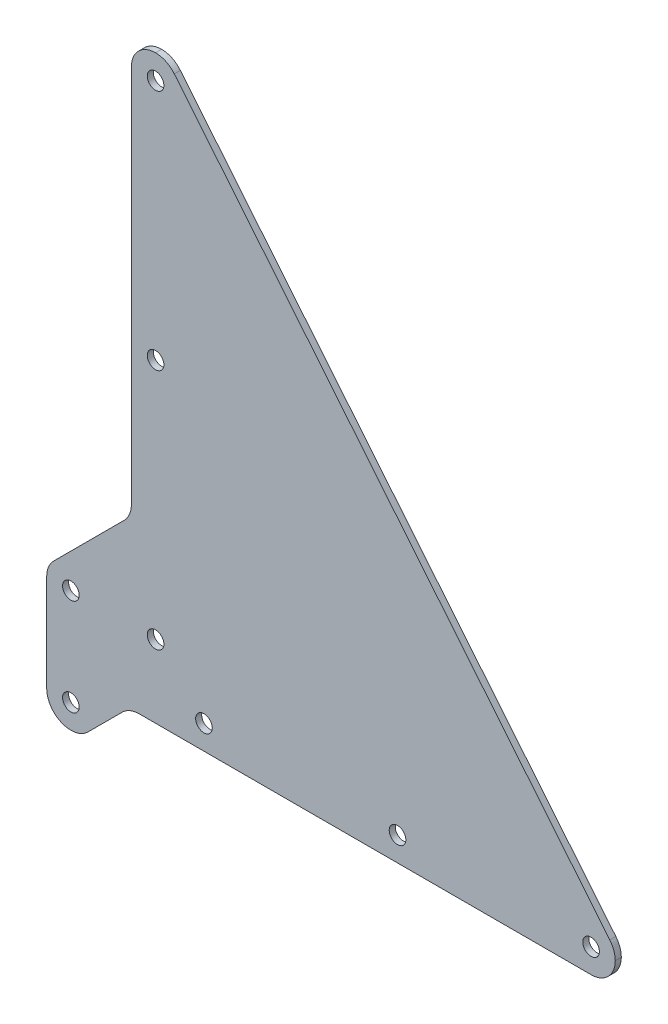
ISO-10303-21;
HEADER;
FILE_DESCRIPTION(('STEP AP214'),'2;1');
FILE_NAME('part.step','',(''),(''),'','','');
FILE_SCHEMA(('AUTOMOTIVE_DESIGN { 1 0 10303 214 1 1 1 1 }'));
ENDSEC;
DATA;
#1=APPLICATION_CONTEXT('core data for automotive mechanical design processes');
#2=APPLICATION_PROTOCOL_DEFINITION('international standard','automotive_design',2000,#1);
#3=PRODUCT_CONTEXT('',#1,'mechanical');
#4=PRODUCT('Part','Part','',(#3));
#5=PRODUCT_RELATED_PRODUCT_CATEGORY('part','',(#4));
#6=PRODUCT_DEFINITION_FORMATION('','',#4);
#7=PRODUCT_DEFINITION_CONTEXT('part definition',#1,'design');
#8=PRODUCT_DEFINITION('design','',#6,#7);
#9=PRODUCT_DEFINITION_SHAPE('','',#8);
#10=(LENGTH_UNIT() NAMED_UNIT(*) SI_UNIT(.MILLI.,.METRE.));
#11=(NAMED_UNIT(*) PLANE_ANGLE_UNIT() SI_UNIT($,.RADIAN.));
#12=(NAMED_UNIT(*) SI_UNIT($,.STERADIAN.) SOLID_ANGLE_UNIT());
#13=UNCERTAINTY_MEASURE_WITH_UNIT(LENGTH_MEASURE(1.E-05),#10,'distance_accuracy_value','');
#14=(GEOMETRIC_REPRESENTATION_CONTEXT(3) GLOBAL_UNCERTAINTY_ASSIGNED_CONTEXT((#13)) GLOBAL_UNIT_ASSIGNED_CONTEXT((#10,
#11,#12)) REPRESENTATION_CONTEXT('',''));
#15=CARTESIAN_POINT('',(0.,0.,0.));
#16=DIRECTION('',(0.,0.,1.));
#17=DIRECTION('',(1.,0.,0.));
#18=AXIS2_PLACEMENT_3D('',#15,#16,#17);
#19=CARTESIAN_POINT('',(0.,0.,0.79375));
#20=DIRECTION('',(0.,0.,1.));
#21=DIRECTION('',(1.,0.,0.));
#22=AXIS2_PLACEMENT_3D('',#19,#20,#21);
#23=PLANE('',#22);
#24=CARTESIAN_POINT('',(114.3,-12.7,0.79375));
#25=DIRECTION('',(0.,0.,1.));
#26=DIRECTION('',(1.,0.,0.));
#27=AXIS2_PLACEMENT_3D('',#24,#25,#26);
#28=CIRCLE('',#27,2.1828125);
#29=CARTESIAN_POINT('',(116.4828125,-12.7,0.79375));
#30=VERTEX_POINT('',#29);
#31=EDGE_CURVE('E366',#30,#30,#28,.T.);
#32=ORIENTED_EDGE('',*,*,#31,.F.);
#33=EDGE_LOOP('',(#32));
#34=FACE_BOUND('',#33,.T.);
#35=CARTESIAN_POINT('',(-22.225,0.,0.79375));
#36=DIRECTION('',(0.,0.,1.));
#37=DIRECTION('',(1.,0.,0.));
#38=AXIS2_PLACEMENT_3D('',#35,#36,#37);
#39=CIRCLE('',#38,2.1828125);
#40=CARTESIAN_POINT('',(-20.0421875,0.,0.79375));
#41=VERTEX_POINT('',#40);
#42=EDGE_CURVE('E350',#41,#41,#39,.T.);
#43=ORIENTED_EDGE('',*,*,#42,.F.);
#44=EDGE_LOOP('',(#43));
#45=FACE_BOUND('',#44,.T.);
#46=CARTESIAN_POINT('',(12.7,-12.7,0.79375));
#47=DIRECTION('',(0.,0.,1.));
#48=DIRECTION('',(1.,0.,0.));
#49=AXIS2_PLACEMENT_3D('',#46,#47,#48);
#50=CIRCLE('',#49,2.1828125);
#51=CARTESIAN_POINT('',(14.8828125,-12.7,0.79375));
#52=VERTEX_POINT('',#51);
#53=EDGE_CURVE('E334',#52,#52,#50,.T.);
#54=ORIENTED_EDGE('',*,*,#53,.F.);
#55=EDGE_LOOP('',(#54));
#56=FACE_BOUND('',#55,.T.);
#57=CARTESIAN_POINT('',(0.,0.,0.79375));
#58=DIRECTION('',(0.,0.,1.));
#59=DIRECTION('',(1.,0.,0.));
#60=AXIS2_PLACEMENT_3D('',#57,#58,#59);
#61=CIRCLE('',#60,2.1828125);
#62=CARTESIAN_POINT('',(2.1828125,0.,0.79375));
#63=VERTEX_POINT('',#62);
#64=EDGE_CURVE('E167',#63,#63,#61,.T.);
#65=ORIENTED_EDGE('',*,*,#64,.F.);
#66=EDGE_LOOP('',(#65));
#67=FACE_BOUND('',#66,.T.);
#68=DIRECTION('',(1.,0.,0.));
#69=VECTOR('',#68,1.);
#70=CARTESIAN_POINT('',(-6.89474387893088,-19.05,0.79375));
#71=LINE('',#70,#69);
#72=CARTESIAN_POINT('',(-4.26448775786173,-19.05,0.79375));
#73=VERTEX_POINT('',#72);
#74=CARTESIAN_POINT('',(114.3,-19.05,0.79375));
#75=VERTEX_POINT('',#74);
#76=EDGE_CURVE('E179',#73,#75,#71,.T.);
#77=ORIENTED_EDGE('',*,*,#76,.T.);
#78=CARTESIAN_POINT('',(114.3,-12.7,0.79375));
#79=DIRECTION('',(0.,0.,1.));
#80=DIRECTION('',(1.,0.,0.));
#81=AXIS2_PLACEMENT_3D('',#78,#79,#80);
#82=CIRCLE('',#81,6.35);
#83=CARTESIAN_POINT('',(120.65,-12.7,0.79375));
#84=VERTEX_POINT('',#83);
#85=EDGE_CURVE('E224',#75,#84,#82,.T.);
#86=ORIENTED_EDGE('',*,*,#85,.T.);
#87=CARTESIAN_POINT('',(114.3,-12.7,0.79375));
#88=DIRECTION('',(0.,0.,1.));
#89=DIRECTION('',(1.,0.,0.));
#90=AXIS2_PLACEMENT_3D('',#87,#88,#89);
#91=CIRCLE('',#90,6.35);
#92=CARTESIAN_POINT('',(119.214628849941,-8.67894003186637,0.79375));
#93=VERTEX_POINT('',#92);
#94=EDGE_CURVE('E221',#84,#93,#91,.T.);
#95=ORIENTED_EDGE('',*,*,#94,.T.);
#96=DIRECTION('',(-0.633237790257263,0.773957299203321,0.));
#97=VECTOR('',#96,1.);
#98=CARTESIAN_POINT('',(120.65,-10.433282548605,0.79375));
#99=LINE('',#98,#97);
#100=CARTESIAN_POINT('',(4.91462884994102,131.021059968134,0.79375));
#101=VERTEX_POINT('',#100);
#102=EDGE_CURVE('E172',#93,#101,#99,.T.);
#103=ORIENTED_EDGE('',*,*,#102,.T.);
#104=CARTESIAN_POINT('',(0.,127.,0.79375));
#105=DIRECTION('',(0.,0.,1.));
#106=DIRECTION('',(1.,0.,0.));
#107=AXIS2_PLACEMENT_3D('',#104,#105,#106);
#108=CIRCLE('',#107,6.35);
#109=CARTESIAN_POINT('',(0.,133.35,0.79375));
#110=VERTEX_POINT('',#109);
#111=EDGE_CURVE('E54',#101,#110,#108,.T.);
#112=ORIENTED_EDGE('',*,*,#111,.T.);
#113=CARTESIAN_POINT('',(0.,127.,0.79375));
#114=DIRECTION('',(0.,0.,1.));
#115=DIRECTION('',(1.,0.,0.));
#116=AXIS2_PLACEMENT_3D('',#113,#114,#115);
#117=CIRCLE('',#116,6.35);
#118=CARTESIAN_POINT('',(-6.35000000000002,127.,0.79375));
#119=VERTEX_POINT('',#118);
#120=EDGE_CURVE('E207',#110,#119,#117,.T.);
#121=ORIENTED_EDGE('',*,*,#120,.T.);
#122=DIRECTION('',(0.,-1.,0.));
#123=VECTOR('',#122,1.);
#124=CARTESIAN_POINT('',(-6.35000000000002,133.35,0.79375));
#125=LINE('',#124,#123);
#126=CARTESIAN_POINT('',(-6.35,27.4855122421382,0.79375));
#127=VERTEX_POINT('',#126);
#128=EDGE_CURVE('E152',#119,#127,#125,.T.);
#129=ORIENTED_EDGE('',*,*,#128,.T.);
#130=CARTESIAN_POINT('',(-12.7,27.4855122421382,0.79375));
#131=DIRECTION('',(0.,0.,1.));
#132=DIRECTION('',(1.,0.,0.));
#133=AXIS2_PLACEMENT_3D('',#130,#131,#132);
#134=CIRCLE('',#133,6.35);
#135=CARTESIAN_POINT('',(-8.20987193946543,22.9953841816037,0.79375));
#136=VERTEX_POINT('',#135);
#137=EDGE_CURVE('E11',#127,#136,#134,.F.);
#138=ORIENTED_EDGE('',*,*,#137,.T.);
#139=DIRECTION('',(-0.707106781186548,-0.707106781186546,0.));
#140=VECTOR('',#139,1.);
#141=CARTESIAN_POINT('',(-6.35,24.8552561210691,0.79375));
#142=LINE('',#141,#140);
#143=CARTESIAN_POINT('',(-26.7151280605346,4.4901280605346,0.79375));
#144=VERTEX_POINT('',#143);
#145=EDGE_CURVE('E289',#136,#144,#142,.T.);
#146=ORIENTED_EDGE('',*,*,#145,.T.);
#147=CARTESIAN_POINT('',(-22.225,0.,0.79375));
#148=DIRECTION('',(0.,0.,1.));
#149=DIRECTION('',(1.,0.,0.));
#150=AXIS2_PLACEMENT_3D('',#147,#148,#149);
#151=CIRCLE('',#150,6.35);
#152=CARTESIAN_POINT('',(-28.575,0.,0.79375));
#153=VERTEX_POINT('',#152);
#154=EDGE_CURVE('E212',#144,#153,#151,.T.);
#155=ORIENTED_EDGE('',*,*,#154,.T.);
#156=DIRECTION('',(0.,-1.,0.));
#157=VECTOR('',#156,1.);
#158=CARTESIAN_POINT('',(-28.575,2.63025612106916,0.79375));
#159=LINE('',#158,#157);
#160=CARTESIAN_POINT('',(-28.575,-25.4,0.79375));
#161=VERTEX_POINT('',#160);
#162=EDGE_CURVE('E315',#153,#161,#159,.T.);
#163=ORIENTED_EDGE('',*,*,#162,.T.);
#164=CARTESIAN_POINT('',(-22.225,-25.4,0.79375));
#165=DIRECTION('',(0.,0.,1.));
#166=DIRECTION('',(1.,0.,0.));
#167=AXIS2_PLACEMENT_3D('',#164,#165,#166);
#168=CIRCLE('',#167,6.35);
#169=CARTESIAN_POINT('',(-22.225,-31.75,0.79375));
#170=VERTEX_POINT('',#169);
#171=EDGE_CURVE('E215',#161,#170,#168,.T.);
#172=ORIENTED_EDGE('',*,*,#171,.T.);
#173=CARTESIAN_POINT('',(-22.225,-25.4,0.79375));
#174=DIRECTION('',(0.,0.,1.));
#175=DIRECTION('',(1.,0.,0.));
#176=AXIS2_PLACEMENT_3D('',#173,#174,#175);
#177=CIRCLE('',#176,6.35);
#178=CARTESIAN_POINT('',(-17.7348719394654,-29.8901280605346,0.79375));
#179=VERTEX_POINT('',#178);
#180=EDGE_CURVE('E218',#170,#179,#177,.T.);
#181=ORIENTED_EDGE('',*,*,#180,.T.);
#182=DIRECTION('',(0.707106781186546,0.707106781186549,0.));
#183=VECTOR('',#182,1.);
#184=CARTESIAN_POINT('',(-19.5947438789308,-31.75,0.79375));
#185=LINE('',#184,#183);
#186=CARTESIAN_POINT('',(-8.75461581839631,-20.9098719394654,0.79375));
#187=VERTEX_POINT('',#186);
#188=EDGE_CURVE('E311',#179,#187,#185,.T.);
#189=ORIENTED_EDGE('',*,*,#188,.T.);
#190=CARTESIAN_POINT('',(-4.26448775786173,-25.4,0.79375));
#191=DIRECTION('',(0.,0.,1.));
#192=DIRECTION('',(1.,0.,0.));
#193=AXIS2_PLACEMENT_3D('',#190,#191,#192);
#194=CIRCLE('',#193,6.35);
#195=EDGE_CURVE('E258',#187,#73,#194,.F.);
#196=ORIENTED_EDGE('',*,*,#195,.T.);
#197=EDGE_LOOP('',(#77,#86,#95,#103,#112,#121,#129,#138,#146,#155,#163,#172,#181,#189,#196));
#198=FACE_BOUND('',#197,.T.);
#199=CARTESIAN_POINT('',(0.,63.5,0.79375));
#200=DIRECTION('',(0.,0.,1.));
#201=DIRECTION('',(1.,0.,0.));
#202=AXIS2_PLACEMENT_3D('',#199,#200,#201);
#203=CIRCLE('',#202,2.1828125);
#204=CARTESIAN_POINT('',(2.18281249999999,63.5,0.79375));
#205=VERTEX_POINT('',#204);
#206=EDGE_CURVE('E326',#205,#205,#203,.T.);
#207=ORIENTED_EDGE('',*,*,#206,.F.);
#208=EDGE_LOOP('',(#207));
#209=FACE_BOUND('',#208,.T.);
#210=CARTESIAN_POINT('',(63.5,-12.7,0.79375));
#211=DIRECTION('',(0.,0.,1.));
#212=DIRECTION('',(1.,0.,0.));
#213=AXIS2_PLACEMENT_3D('',#210,#211,#212);
#214=CIRCLE('',#213,2.1828125);
#215=CARTESIAN_POINT('',(65.6828125,-12.7,0.79375));
#216=VERTEX_POINT('',#215);
#217=EDGE_CURVE('E342',#216,#216,#214,.T.);
#218=ORIENTED_EDGE('',*,*,#217,.F.);
#219=EDGE_LOOP('',(#218));
#220=FACE_BOUND('',#219,.T.);
#221=CARTESIAN_POINT('',(-22.225,-25.4,0.79375));
#222=DIRECTION('',(0.,0.,1.));
#223=DIRECTION('',(1.,0.,0.));
#224=AXIS2_PLACEMENT_3D('',#221,#222,#223);
#225=CIRCLE('',#224,2.1828125);
#226=CARTESIAN_POINT('',(-20.0421875,-25.4,0.79375));
#227=VERTEX_POINT('',#226);
#228=EDGE_CURVE('E358',#227,#227,#225,.T.);
#229=ORIENTED_EDGE('',*,*,#228,.F.);
#230=EDGE_LOOP('',(#229));
#231=FACE_BOUND('',#230,.T.);
#232=CARTESIAN_POINT('',(0.,127.,0.79375));
#233=DIRECTION('',(0.,0.,1.));
#234=DIRECTION('',(1.,0.,0.));
#235=AXIS2_PLACEMENT_3D('',#232,#233,#234);
#236=CIRCLE('',#235,2.1828125);
#237=CARTESIAN_POINT('',(2.18281249999999,127.,0.79375));
#238=VERTEX_POINT('',#237);
#239=EDGE_CURVE('E374',#238,#238,#236,.T.);
#240=ORIENTED_EDGE('',*,*,#239,.F.);
#241=EDGE_LOOP('',(#240));
#242=FACE_BOUND('',#241,.T.);
#243=ADVANCED_FACE('F36',(#34,#45,#56,#67,#198,#209,#220,#231,#242),#23,.T.);
#244=CARTESIAN_POINT('',(0.,0.,-0.79375));
#245=DIRECTION('',(0.,0.,1.));
#246=DIRECTION('',(1.,0.,0.));
#247=AXIS2_PLACEMENT_3D('',#244,#245,#246);
#248=PLANE('',#247);
#249=CARTESIAN_POINT('',(114.3,-12.7,-0.79375));
#250=DIRECTION('',(0.,0.,1.));
#251=DIRECTION('',(1.,0.,0.));
#252=AXIS2_PLACEMENT_3D('',#249,#250,#251);
#253=CIRCLE('',#252,6.35);
#254=CARTESIAN_POINT('',(119.214628849941,-8.67894003186637,-0.79375));
#255=VERTEX_POINT('',#254);
#256=CARTESIAN_POINT('',(120.65,-12.7,-0.79375));
#257=VERTEX_POINT('',#256);
#258=EDGE_CURVE('E193',#255,#257,#253,.F.);
#259=ORIENTED_EDGE('',*,*,#258,.T.);
#260=CARTESIAN_POINT('',(114.3,-12.7,-0.79375));
#261=DIRECTION('',(0.,0.,1.));
#262=DIRECTION('',(1.,0.,0.));
#263=AXIS2_PLACEMENT_3D('',#260,#261,#262);
#264=CIRCLE('',#263,6.35);
#265=CARTESIAN_POINT('',(114.3,-19.05,-0.79375));
#266=VERTEX_POINT('',#265);
#267=EDGE_CURVE('E196',#257,#266,#264,.F.);
#268=ORIENTED_EDGE('',*,*,#267,.T.);
#269=DIRECTION('',(1.,0.,0.));
#270=VECTOR('',#269,1.);
#271=CARTESIAN_POINT('',(-6.89474387893088,-19.05,-0.79375));
#272=LINE('',#271,#270);
#273=CARTESIAN_POINT('',(-4.26448775786173,-19.05,-0.79375));
#274=VERTEX_POINT('',#273);
#275=EDGE_CURVE('E285',#274,#266,#272,.T.);
#276=ORIENTED_EDGE('',*,*,#275,.F.);
#277=CARTESIAN_POINT('',(-4.26448775786173,-25.4,-0.79375));
#278=DIRECTION('',(0.,0.,1.));
#279=DIRECTION('',(1.,0.,0.));
#280=AXIS2_PLACEMENT_3D('',#277,#278,#279);
#281=CIRCLE('',#280,6.35);
#282=CARTESIAN_POINT('',(-8.75461581839631,-20.9098719394654,-0.79375));
#283=VERTEX_POINT('',#282);
#284=EDGE_CURVE('E255',#274,#283,#281,.T.);
#285=ORIENTED_EDGE('',*,*,#284,.T.);
#286=DIRECTION('',(0.707106781186546,0.707106781186549,0.));
#287=VECTOR('',#286,1.);
#288=CARTESIAN_POINT('',(-19.5947438789308,-31.75,-0.79375));
#289=LINE('',#288,#287);
#290=CARTESIAN_POINT('',(-17.7348719394654,-29.8901280605346,-0.79375));
#291=VERTEX_POINT('',#290);
#292=EDGE_CURVE('E292',#291,#283,#289,.T.);
#293=ORIENTED_EDGE('',*,*,#292,.F.);
#294=CARTESIAN_POINT('',(-22.225,-25.4,-0.79375));
#295=DIRECTION('',(0.,0.,1.));
#296=DIRECTION('',(1.,0.,0.));
#297=AXIS2_PLACEMENT_3D('',#294,#295,#296);
#298=CIRCLE('',#297,6.35);
#299=CARTESIAN_POINT('',(-22.225,-31.75,-0.79375));
#300=VERTEX_POINT('',#299);
#301=EDGE_CURVE('E190',#291,#300,#298,.F.);
#302=ORIENTED_EDGE('',*,*,#301,.T.);
#303=CARTESIAN_POINT('',(-22.225,-25.4,-0.79375));
#304=DIRECTION('',(0.,0.,1.));
#305=DIRECTION('',(1.,0.,0.));
#306=AXIS2_PLACEMENT_3D('',#303,#304,#305);
#307=CIRCLE('',#306,6.35);
#308=CARTESIAN_POINT('',(-28.575,-25.4,-0.79375));
#309=VERTEX_POINT('',#308);
#310=EDGE_CURVE('E187',#300,#309,#307,.F.);
#311=ORIENTED_EDGE('',*,*,#310,.T.);
#312=DIRECTION('',(0.,-1.,0.));
#313=VECTOR('',#312,1.);
#314=CARTESIAN_POINT('',(-28.575,2.63025612106916,-0.79375));
#315=LINE('',#314,#313);
#316=CARTESIAN_POINT('',(-28.575,0.,-0.79375));
#317=VERTEX_POINT('',#316);
#318=EDGE_CURVE('E299',#317,#309,#315,.T.);
#319=ORIENTED_EDGE('',*,*,#318,.F.);
#320=CARTESIAN_POINT('',(-22.225,0.,-0.79375));
#321=DIRECTION('',(0.,0.,1.));
#322=DIRECTION('',(1.,0.,0.));
#323=AXIS2_PLACEMENT_3D('',#320,#321,#322);
#324=CIRCLE('',#323,6.35);
#325=CARTESIAN_POINT('',(-26.7151280605346,4.4901280605346,-0.79375));
#326=VERTEX_POINT('',#325);
#327=EDGE_CURVE('E177',#317,#326,#324,.F.);
#328=ORIENTED_EDGE('',*,*,#327,.T.);
#329=DIRECTION('',(-0.707106781186548,-0.707106781186546,0.));
#330=VECTOR('',#329,1.);
#331=CARTESIAN_POINT('',(-6.35,24.8552561210691,-0.79375));
#332=LINE('',#331,#330);
#333=CARTESIAN_POINT('',(-8.20987193946543,22.9953841816037,-0.79375));
#334=VERTEX_POINT('',#333);
#335=EDGE_CURVE('E166',#334,#326,#332,.T.);
#336=ORIENTED_EDGE('',*,*,#335,.F.);
#337=CARTESIAN_POINT('',(-12.7,27.4855122421382,-0.79375));
#338=DIRECTION('',(0.,0.,1.));
#339=DIRECTION('',(1.,0.,0.));
#340=AXIS2_PLACEMENT_3D('',#337,#338,#339);
#341=CIRCLE('',#340,6.35);
#342=CARTESIAN_POINT('',(-6.35,27.4855122421382,-0.79375));
#343=VERTEX_POINT('',#342);
#344=EDGE_CURVE('E46',#334,#343,#341,.T.);
#345=ORIENTED_EDGE('',*,*,#344,.T.);
#346=DIRECTION('',(0.,-1.,0.));
#347=VECTOR('',#346,1.);
#348=CARTESIAN_POINT('',(-6.35000000000002,133.35,-0.79375));
#349=LINE('',#348,#347);
#350=CARTESIAN_POINT('',(-6.35000000000002,127.,-0.79375));
#351=VERTEX_POINT('',#350);
#352=EDGE_CURVE('E149',#351,#343,#349,.T.);
#353=ORIENTED_EDGE('',*,*,#352,.F.);
#354=CARTESIAN_POINT('',(0.,127.,-0.79375));
#355=DIRECTION('',(0.,0.,1.));
#356=DIRECTION('',(1.,0.,0.));
#357=AXIS2_PLACEMENT_3D('',#354,#355,#356);
#358=CIRCLE('',#357,6.35);
#359=CARTESIAN_POINT('',(0.,133.35,-0.79375));
#360=VERTEX_POINT('',#359);
#361=EDGE_CURVE('E162',#351,#360,#358,.F.);
#362=ORIENTED_EDGE('',*,*,#361,.T.);
#363=CARTESIAN_POINT('',(0.,127.,-0.79375));
#364=DIRECTION('',(0.,0.,1.));
#365=DIRECTION('',(1.,0.,0.));
#366=AXIS2_PLACEMENT_3D('',#363,#364,#365);
#367=CIRCLE('',#366,6.35);
#368=CARTESIAN_POINT('',(4.91462884994102,131.021059968134,-0.79375));
#369=VERTEX_POINT('',#368);
#370=EDGE_CURVE('E171',#360,#369,#367,.F.);
#371=ORIENTED_EDGE('',*,*,#370,.T.);
#372=DIRECTION('',(-0.633237790257263,0.773957299203321,0.));
#373=VECTOR('',#372,1.);
#374=CARTESIAN_POINT('',(120.65,-10.433282548605,-0.79375));
#375=LINE('',#374,#373);
#376=EDGE_CURVE('E182',#255,#369,#375,.T.);
#377=ORIENTED_EDGE('',*,*,#376,.F.);
#378=EDGE_LOOP('',(#259,#268,#276,#285,#293,#302,#311,#319,#328,#336,#345,#353,#362,#371,#377));
#379=FACE_BOUND('',#378,.T.);
#380=CARTESIAN_POINT('',(0.,0.,-0.79375));
#381=DIRECTION('',(0.,0.,1.));
#382=DIRECTION('',(1.,0.,0.));
#383=AXIS2_PLACEMENT_3D('',#380,#381,#382);
#384=CIRCLE('',#383,2.1828125);
#385=CARTESIAN_POINT('',(2.1828125,0.,-0.79375));
#386=VERTEX_POINT('',#385);
#387=EDGE_CURVE('E322',#386,#386,#384,.T.);
#388=ORIENTED_EDGE('',*,*,#387,.T.);
#389=EDGE_LOOP('',(#388));
#390=FACE_BOUND('',#389,.T.);
#391=CARTESIAN_POINT('',(0.,63.5,-0.79375));
#392=DIRECTION('',(0.,0.,1.));
#393=DIRECTION('',(1.,0.,0.));
#394=AXIS2_PLACEMENT_3D('',#391,#392,#393);
#395=CIRCLE('',#394,2.1828125);
#396=CARTESIAN_POINT('',(2.18281249999999,63.5,-0.79375));
#397=VERTEX_POINT('',#396);
#398=EDGE_CURVE('E330',#397,#397,#395,.T.);
#399=ORIENTED_EDGE('',*,*,#398,.T.);
#400=EDGE_LOOP('',(#399));
#401=FACE_BOUND('',#400,.T.);
#402=CARTESIAN_POINT('',(12.7,-12.7,-0.79375));
#403=DIRECTION('',(0.,0.,1.));
#404=DIRECTION('',(1.,0.,0.));
#405=AXIS2_PLACEMENT_3D('',#402,#403,#404);
#406=CIRCLE('',#405,2.1828125);
#407=CARTESIAN_POINT('',(14.8828125,-12.7,-0.79375));
#408=VERTEX_POINT('',#407);
#409=EDGE_CURVE('E338',#408,#408,#406,.T.);
#410=ORIENTED_EDGE('',*,*,#409,.T.);
#411=EDGE_LOOP('',(#410));
#412=FACE_BOUND('',#411,.T.);
#413=CARTESIAN_POINT('',(63.5,-12.7,-0.79375));
#414=DIRECTION('',(0.,0.,1.));
#415=DIRECTION('',(1.,0.,0.));
#416=AXIS2_PLACEMENT_3D('',#413,#414,#415);
#417=CIRCLE('',#416,2.1828125);
#418=CARTESIAN_POINT('',(65.6828125,-12.7,-0.79375));
#419=VERTEX_POINT('',#418);
#420=EDGE_CURVE('E346',#419,#419,#417,.T.);
#421=ORIENTED_EDGE('',*,*,#420,.T.);
#422=EDGE_LOOP('',(#421));
#423=FACE_BOUND('',#422,.T.);
#424=CARTESIAN_POINT('',(-22.225,0.,-0.79375));
#425=DIRECTION('',(0.,0.,1.));
#426=DIRECTION('',(1.,0.,0.));
#427=AXIS2_PLACEMENT_3D('',#424,#425,#426);
#428=CIRCLE('',#427,2.1828125);
#429=CARTESIAN_POINT('',(-20.0421875,0.,-0.79375));
#430=VERTEX_POINT('',#429);
#431=EDGE_CURVE('E354',#430,#430,#428,.T.);
#432=ORIENTED_EDGE('',*,*,#431,.T.);
#433=EDGE_LOOP('',(#432));
#434=FACE_BOUND('',#433,.T.);
#435=CARTESIAN_POINT('',(-22.225,-25.4,-0.79375));
#436=DIRECTION('',(0.,0.,1.));
#437=DIRECTION('',(1.,0.,0.));
#438=AXIS2_PLACEMENT_3D('',#435,#436,#437);
#439=CIRCLE('',#438,2.1828125);
#440=CARTESIAN_POINT('',(-20.0421875,-25.4,-0.79375));
#441=VERTEX_POINT('',#440);
#442=EDGE_CURVE('E362',#441,#441,#439,.T.);
#443=ORIENTED_EDGE('',*,*,#442,.T.);
#444=EDGE_LOOP('',(#443));
#445=FACE_BOUND('',#444,.T.);
#446=CARTESIAN_POINT('',(114.3,-12.7,-0.79375));
#447=DIRECTION('',(0.,0.,1.));
#448=DIRECTION('',(1.,0.,0.));
#449=AXIS2_PLACEMENT_3D('',#446,#447,#448);
#450=CIRCLE('',#449,2.1828125);
#451=CARTESIAN_POINT('',(116.4828125,-12.7,-0.79375));
#452=VERTEX_POINT('',#451);
#453=EDGE_CURVE('E370',#452,#452,#450,.T.);
#454=ORIENTED_EDGE('',*,*,#453,.T.);
#455=EDGE_LOOP('',(#454));
#456=FACE_BOUND('',#455,.T.);
#457=CARTESIAN_POINT('',(0.,127.,-0.79375));
#458=DIRECTION('',(0.,0.,1.));
#459=DIRECTION('',(1.,0.,0.));
#460=AXIS2_PLACEMENT_3D('',#457,#458,#459);
#461=CIRCLE('',#460,2.1828125);
#462=CARTESIAN_POINT('',(2.18281249999999,127.,-0.79375));
#463=VERTEX_POINT('',#462);
#464=EDGE_CURVE('E266',#463,#463,#461,.T.);
#465=ORIENTED_EDGE('',*,*,#464,.T.);
#466=EDGE_LOOP('',(#465));
#467=FACE_BOUND('',#466,.T.);
#468=ADVANCED_FACE('F160',(#379,#390,#401,#412,#423,#434,#445,#456,#467),#248,.F.);
#469=CARTESIAN_POINT('',(-6.35000000000002,133.35,0.79375));
#470=DIRECTION('',(1.,0.,0.));
#471=DIRECTION('',(0.,1.,0.));
#472=AXIS2_PLACEMENT_3D('',#469,#470,#471);
#473=PLANE('',#472);
#474=ORIENTED_EDGE('',*,*,#352,.T.);
#475=DIRECTION('',(0.,0.,-1.));
#476=VECTOR('',#475,1.);
#477=CARTESIAN_POINT('',(-6.35,27.4855122421382,0.79375));
#478=LINE('',#477,#476);
#479=EDGE_CURVE('E156',#343,#127,#478,.F.);
#480=ORIENTED_EDGE('',*,*,#479,.T.);
#481=ORIENTED_EDGE('',*,*,#128,.F.);
#482=DIRECTION('',(0.,0.,-1.));
#483=VECTOR('',#482,1.);
#484=CARTESIAN_POINT('',(-6.35000000000002,127.,0.79375));
#485=LINE('',#484,#483);
#486=EDGE_CURVE('E146',#119,#351,#485,.T.);
#487=ORIENTED_EDGE('',*,*,#486,.T.);
#488=EDGE_LOOP('',(#474,#480,#481,#487));
#489=FACE_BOUND('',#488,.T.);
#490=ADVANCED_FACE('F148',(#489),#473,.F.);
#491=CARTESIAN_POINT('',(-6.35,24.8552561210691,0.79375));
#492=DIRECTION('',(0.707106781186546,-0.707106781186549,0.));
#493=DIRECTION('',(0.707106781186549,0.707106781186546,0.));
#494=AXIS2_PLACEMENT_3D('',#491,#492,#493);
#495=PLANE('',#494);
#496=ORIENTED_EDGE('',*,*,#335,.T.);
#497=DIRECTION('',(0.,0.,-1.));
#498=VECTOR('',#497,1.);
#499=CARTESIAN_POINT('',(-26.7151280605346,4.49012806053459,0.79375));
#500=LINE('',#499,#498);
#501=EDGE_CURVE('E157',#326,#144,#500,.F.);
#502=ORIENTED_EDGE('',*,*,#501,.T.);
#503=ORIENTED_EDGE('',*,*,#145,.F.);
#504=DIRECTION('',(0.,0.,-1.));
#505=VECTOR('',#504,1.);
#506=CARTESIAN_POINT('',(-8.20987193946543,22.9953841816037,-0.79375));
#507=LINE('',#506,#505);
#508=EDGE_CURVE('E247',#136,#334,#507,.T.);
#509=ORIENTED_EDGE('',*,*,#508,.T.);
#510=EDGE_LOOP('',(#496,#502,#503,#509));
#511=FACE_BOUND('',#510,.T.);
#512=ADVANCED_FACE('F414',(#511),#495,.F.);
#513=CARTESIAN_POINT('',(-28.575,2.63025612106916,0.79375));
#514=DIRECTION('',(1.,0.,0.));
#515=DIRECTION('',(0.,1.,0.));
#516=AXIS2_PLACEMENT_3D('',#513,#514,#515);
#517=PLANE('',#516);
#518=ORIENTED_EDGE('',*,*,#318,.T.);
#519=DIRECTION('',(0.,0.,-1.));
#520=VECTOR('',#519,1.);
#521=CARTESIAN_POINT('',(-28.575,-25.4,0.79375));
#522=LINE('',#521,#520);
#523=EDGE_CURVE('E244',#309,#161,#522,.F.);
#524=ORIENTED_EDGE('',*,*,#523,.T.);
#525=ORIENTED_EDGE('',*,*,#162,.F.);
#526=DIRECTION('',(0.,0.,-1.));
#527=VECTOR('',#526,1.);
#528=CARTESIAN_POINT('',(-28.575,0.,0.79375));
#529=LINE('',#528,#527);
#530=EDGE_CURVE('E240',#153,#317,#529,.T.);
#531=ORIENTED_EDGE('',*,*,#530,.T.);
#532=EDGE_LOOP('',(#518,#524,#525,#531));
#533=FACE_BOUND('',#532,.T.);
#534=ADVANCED_FACE('F410',(#533),#517,.F.);
#535=CARTESIAN_POINT('',(-19.5947438789308,-31.75,0.79375));
#536=DIRECTION('',(-0.707106781186549,0.707106781186546,0.));
#537=DIRECTION('',(-0.707106781186546,-0.707106781186549,0.));
#538=AXIS2_PLACEMENT_3D('',#535,#536,#537);
#539=PLANE('',#538);
#540=ORIENTED_EDGE('',*,*,#292,.T.);
#541=DIRECTION('',(0.,0.,-1.));
#542=VECTOR('',#541,1.);
#543=CARTESIAN_POINT('',(-8.75461581839631,-20.9098719394654,0.79375));
#544=LINE('',#543,#542);
#545=EDGE_CURVE('E237',#283,#187,#544,.F.);
#546=ORIENTED_EDGE('',*,*,#545,.T.);
#547=ORIENTED_EDGE('',*,*,#188,.F.);
#548=DIRECTION('',(0.,0.,-1.));
#549=VECTOR('',#548,1.);
#550=CARTESIAN_POINT('',(-17.7348719394654,-29.8901280605346,0.79375));
#551=LINE('',#550,#549);
#552=EDGE_CURVE('E233',#179,#291,#551,.T.);
#553=ORIENTED_EDGE('',*,*,#552,.T.);
#554=EDGE_LOOP('',(#540,#546,#547,#553));
#555=FACE_BOUND('',#554,.T.);
#556=ADVANCED_FACE('F407',(#555),#539,.F.);
#557=CARTESIAN_POINT('',(-6.89474387893088,-19.05,0.79375));
#558=DIRECTION('',(0.,1.,0.));
#559=DIRECTION('',(0.,0.,1.));
#560=AXIS2_PLACEMENT_3D('',#557,#558,#559);
#561=PLANE('',#560);
#562=ORIENTED_EDGE('',*,*,#275,.T.);
#563=DIRECTION('',(0.,0.,-1.));
#564=VECTOR('',#563,1.);
#565=CARTESIAN_POINT('',(114.3,-19.05,0.79375));
#566=LINE('',#565,#564);
#567=EDGE_CURVE('E203',#266,#75,#566,.F.);
#568=ORIENTED_EDGE('',*,*,#567,.T.);
#569=ORIENTED_EDGE('',*,*,#76,.F.);
#570=DIRECTION('',(0.,0.,-1.));
#571=VECTOR('',#570,1.);
#572=CARTESIAN_POINT('',(-4.26448775786173,-19.05,-0.79375));
#573=LINE('',#572,#571);
#574=EDGE_CURVE('E199',#73,#274,#573,.T.);
#575=ORIENTED_EDGE('',*,*,#574,.T.);
#576=EDGE_LOOP('',(#562,#568,#569,#575));
#577=FACE_BOUND('',#576,.T.);
#578=ADVANCED_FACE('F404',(#577),#561,.F.);
#579=CARTESIAN_POINT('',(120.65,-10.433282548605,0.79375));
#580=DIRECTION('',(-0.773957299203321,-0.633237790257263,0.));
#581=DIRECTION('',(0.633237790257263,-0.773957299203321,0.));
#582=AXIS2_PLACEMENT_3D('',#579,#580,#581);
#583=PLANE('',#582);
#584=ORIENTED_EDGE('',*,*,#102,.F.);
#585=DIRECTION('',(0.,0.,-1.));
#586=VECTOR('',#585,1.);
#587=CARTESIAN_POINT('',(119.214628849941,-8.67894003186637,0.79375));
#588=LINE('',#587,#586);
#589=EDGE_CURVE('E230',#93,#255,#588,.T.);
#590=ORIENTED_EDGE('',*,*,#589,.T.);
#591=ORIENTED_EDGE('',*,*,#376,.T.);
#592=DIRECTION('',(0.,0.,-1.));
#593=VECTOR('',#592,1.);
#594=CARTESIAN_POINT('',(4.91462884994104,131.021059968134,0.79375));
#595=LINE('',#594,#593);
#596=EDGE_CURVE('E227',#369,#101,#595,.F.);
#597=ORIENTED_EDGE('',*,*,#596,.T.);
#598=EDGE_LOOP('',(#584,#590,#591,#597));
#599=FACE_BOUND('',#598,.T.);
#600=ADVANCED_FACE('F282',(#599),#583,.F.);
#601=CARTESIAN_POINT('',(0.,0.,0.79375));
#602=DIRECTION('',(0.,0.,-1.));
#603=DIRECTION('',(-1.,0.,0.));
#604=AXIS2_PLACEMENT_3D('',#601,#602,#603);
#605=CYLINDRICAL_SURFACE('',#604,2.1828125);
#606=ORIENTED_EDGE('',*,*,#64,.T.);
#607=EDGE_LOOP('',(#606));
#608=FACE_BOUND('',#607,.T.);
#609=ORIENTED_EDGE('',*,*,#387,.F.);
#610=EDGE_LOOP('',(#609));
#611=FACE_BOUND('',#610,.T.);
#612=ADVANCED_FACE('F399',(#608,#611),#605,.F.);
#613=CARTESIAN_POINT('',(0.,63.5,0.79375));
#614=DIRECTION('',(0.,0.,-1.));
#615=DIRECTION('',(-1.,0.,0.));
#616=AXIS2_PLACEMENT_3D('',#613,#614,#615);
#617=CYLINDRICAL_SURFACE('',#616,2.1828125);
#618=ORIENTED_EDGE('',*,*,#206,.T.);
#619=EDGE_LOOP('',(#618));
#620=FACE_BOUND('',#619,.T.);
#621=ORIENTED_EDGE('',*,*,#398,.F.);
#622=EDGE_LOOP('',(#621));
#623=FACE_BOUND('',#622,.T.);
#624=ADVANCED_FACE('F526',(#620,#623),#617,.F.);
#625=CARTESIAN_POINT('',(12.7,-12.7,0.79375));
#626=DIRECTION('',(0.,0.,-1.));
#627=DIRECTION('',(-1.,0.,0.));
#628=AXIS2_PLACEMENT_3D('',#625,#626,#627);
#629=CYLINDRICAL_SURFACE('',#628,2.1828125);
#630=ORIENTED_EDGE('',*,*,#53,.T.);
#631=EDGE_LOOP('',(#630));
#632=FACE_BOUND('',#631,.T.);
#633=ORIENTED_EDGE('',*,*,#409,.F.);
#634=EDGE_LOOP('',(#633));
#635=FACE_BOUND('',#634,.T.);
#636=ADVANCED_FACE('F518',(#632,#635),#629,.F.);
#637=CARTESIAN_POINT('',(63.5,-12.7,0.79375));
#638=DIRECTION('',(0.,0.,-1.));
#639=DIRECTION('',(-1.,0.,0.));
#640=AXIS2_PLACEMENT_3D('',#637,#638,#639);
#641=CYLINDRICAL_SURFACE('',#640,2.1828125);
#642=ORIENTED_EDGE('',*,*,#217,.T.);
#643=EDGE_LOOP('',(#642));
#644=FACE_BOUND('',#643,.T.);
#645=ORIENTED_EDGE('',*,*,#420,.F.);
#646=EDGE_LOOP('',(#645));
#647=FACE_BOUND('',#646,.T.);
#648=ADVANCED_FACE('F510',(#644,#647),#641,.F.);
#649=CARTESIAN_POINT('',(-22.225,0.,0.79375));
#650=DIRECTION('',(0.,0.,-1.));
#651=DIRECTION('',(-1.,0.,0.));
#652=AXIS2_PLACEMENT_3D('',#649,#650,#651);
#653=CYLINDRICAL_SURFACE('',#652,2.1828125);
#654=ORIENTED_EDGE('',*,*,#42,.T.);
#655=EDGE_LOOP('',(#654));
#656=FACE_BOUND('',#655,.T.);
#657=ORIENTED_EDGE('',*,*,#431,.F.);
#658=EDGE_LOOP('',(#657));
#659=FACE_BOUND('',#658,.T.);
#660=ADVANCED_FACE('F502',(#656,#659),#653,.F.);
#661=CARTESIAN_POINT('',(-22.225,-25.4,0.79375));
#662=DIRECTION('',(0.,0.,-1.));
#663=DIRECTION('',(-1.,0.,0.));
#664=AXIS2_PLACEMENT_3D('',#661,#662,#663);
#665=CYLINDRICAL_SURFACE('',#664,2.1828125);
#666=ORIENTED_EDGE('',*,*,#228,.T.);
#667=EDGE_LOOP('',(#666));
#668=FACE_BOUND('',#667,.T.);
#669=ORIENTED_EDGE('',*,*,#442,.F.);
#670=EDGE_LOOP('',(#669));
#671=FACE_BOUND('',#670,.T.);
#672=ADVANCED_FACE('F494',(#668,#671),#665,.F.);
#673=CARTESIAN_POINT('',(114.3,-12.7,0.79375));
#674=DIRECTION('',(0.,0.,-1.));
#675=DIRECTION('',(-1.,0.,0.));
#676=AXIS2_PLACEMENT_3D('',#673,#674,#675);
#677=CYLINDRICAL_SURFACE('',#676,2.1828125);
#678=ORIENTED_EDGE('',*,*,#31,.T.);
#679=EDGE_LOOP('',(#678));
#680=FACE_BOUND('',#679,.T.);
#681=ORIENTED_EDGE('',*,*,#453,.F.);
#682=EDGE_LOOP('',(#681));
#683=FACE_BOUND('',#682,.T.);
#684=ADVANCED_FACE('F487',(#680,#683),#677,.F.);
#685=CARTESIAN_POINT('',(0.,127.,0.79375));
#686=DIRECTION('',(0.,0.,-1.));
#687=DIRECTION('',(-1.,0.,0.));
#688=AXIS2_PLACEMENT_3D('',#685,#686,#687);
#689=CYLINDRICAL_SURFACE('',#688,2.1828125);
#690=ORIENTED_EDGE('',*,*,#239,.T.);
#691=EDGE_LOOP('',(#690));
#692=FACE_BOUND('',#691,.T.);
#693=ORIENTED_EDGE('',*,*,#464,.F.);
#694=EDGE_LOOP('',(#693));
#695=FACE_BOUND('',#694,.T.);
#696=ADVANCED_FACE('F386',(#692,#695),#689,.F.);
#697=CARTESIAN_POINT('',(114.3,-12.7,0.79375));
#698=DIRECTION('',(0.,0.,-1.));
#699=DIRECTION('',(-1.,0.,0.));
#700=AXIS2_PLACEMENT_3D('',#697,#698,#699);
#701=CYLINDRICAL_SURFACE('',#700,6.35);
#702=ORIENTED_EDGE('',*,*,#589,.F.);
#703=ORIENTED_EDGE('',*,*,#94,.F.);
#704=DIRECTION('',(0.,0.,-1.));
#705=VECTOR('',#704,1.);
#706=CARTESIAN_POINT('',(120.65,-12.7,0.79375));
#707=LINE('',#706,#705);
#708=EDGE_CURVE('E263',#257,#84,#707,.F.);
#709=ORIENTED_EDGE('',*,*,#708,.F.);
#710=ORIENTED_EDGE('',*,*,#258,.F.);
#711=EDGE_LOOP('',(#702,#703,#709,#710));
#712=FACE_BOUND('',#711,.T.);
#713=ADVANCED_FACE('F425',(#712),#701,.T.);
#714=CARTESIAN_POINT('',(114.3,-12.7,0.79375));
#715=DIRECTION('',(0.,0.,-1.));
#716=DIRECTION('',(-1.,0.,0.));
#717=AXIS2_PLACEMENT_3D('',#714,#715,#716);
#718=CYLINDRICAL_SURFACE('',#717,6.35);
#719=ORIENTED_EDGE('',*,*,#85,.F.);
#720=ORIENTED_EDGE('',*,*,#567,.F.);
#721=ORIENTED_EDGE('',*,*,#267,.F.);
#722=ORIENTED_EDGE('',*,*,#708,.T.);
#723=EDGE_LOOP('',(#719,#720,#721,#722));
#724=FACE_BOUND('',#723,.T.);
#725=ADVANCED_FACE('F421',(#724),#718,.T.);
#726=CARTESIAN_POINT('',(-4.26448775786173,-25.4,0.79375));
#727=DIRECTION('',(0.,0.,1.));
#728=DIRECTION('',(1.,0.,0.));
#729=AXIS2_PLACEMENT_3D('',#726,#727,#728);
#730=CYLINDRICAL_SURFACE('',#729,6.35);
#731=ORIENTED_EDGE('',*,*,#195,.F.);
#732=ORIENTED_EDGE('',*,*,#545,.F.);
#733=ORIENTED_EDGE('',*,*,#284,.F.);
#734=ORIENTED_EDGE('',*,*,#574,.F.);
#735=EDGE_LOOP('',(#731,#732,#733,#734));
#736=FACE_BOUND('',#735,.T.);
#737=ADVANCED_FACE('F424',(#736),#730,.F.);
#738=CARTESIAN_POINT('',(-22.225,-25.4,0.79375));
#739=DIRECTION('',(0.,0.,-1.));
#740=DIRECTION('',(-1.,0.,0.));
#741=AXIS2_PLACEMENT_3D('',#738,#739,#740);
#742=CYLINDRICAL_SURFACE('',#741,6.35);
#743=DIRECTION('',(0.,0.,-1.));
#744=VECTOR('',#743,1.);
#745=CARTESIAN_POINT('',(-22.225,-31.75,0.79375));
#746=LINE('',#745,#744);
#747=EDGE_CURVE('E267',#170,#300,#746,.T.);
#748=ORIENTED_EDGE('',*,*,#747,.F.);
#749=ORIENTED_EDGE('',*,*,#171,.F.);
#750=ORIENTED_EDGE('',*,*,#523,.F.);
#751=ORIENTED_EDGE('',*,*,#310,.F.);
#752=EDGE_LOOP('',(#748,#749,#750,#751));
#753=FACE_BOUND('',#752,.T.);
#754=ADVANCED_FACE('F432',(#753),#742,.T.);
#755=CARTESIAN_POINT('',(-22.225,-25.4,0.79375));
#756=DIRECTION('',(0.,0.,-1.));
#757=DIRECTION('',(-1.,0.,0.));
#758=AXIS2_PLACEMENT_3D('',#755,#756,#757);
#759=CYLINDRICAL_SURFACE('',#758,6.35);
#760=ORIENTED_EDGE('',*,*,#180,.F.);
#761=ORIENTED_EDGE('',*,*,#747,.T.);
#762=ORIENTED_EDGE('',*,*,#301,.F.);
#763=ORIENTED_EDGE('',*,*,#552,.F.);
#764=EDGE_LOOP('',(#760,#761,#762,#763));
#765=FACE_BOUND('',#764,.T.);
#766=ADVANCED_FACE('F434',(#765),#759,.T.);
#767=CARTESIAN_POINT('',(-22.225,0.,0.79375));
#768=DIRECTION('',(0.,0.,-1.));
#769=DIRECTION('',(-1.,0.,0.));
#770=AXIS2_PLACEMENT_3D('',#767,#768,#769);
#771=CYLINDRICAL_SURFACE('',#770,6.35);
#772=ORIENTED_EDGE('',*,*,#154,.F.);
#773=ORIENTED_EDGE('',*,*,#501,.F.);
#774=ORIENTED_EDGE('',*,*,#327,.F.);
#775=ORIENTED_EDGE('',*,*,#530,.F.);
#776=EDGE_LOOP('',(#772,#773,#774,#775));
#777=FACE_BOUND('',#776,.T.);
#778=ADVANCED_FACE('F437',(#777),#771,.T.);
#779=CARTESIAN_POINT('',(-12.7,27.4855122421382,0.79375));
#780=DIRECTION('',(0.,0.,1.));
#781=DIRECTION('',(1.,0.,0.));
#782=AXIS2_PLACEMENT_3D('',#779,#780,#781);
#783=CYLINDRICAL_SURFACE('',#782,6.35);
#784=ORIENTED_EDGE('',*,*,#137,.F.);
#785=ORIENTED_EDGE('',*,*,#479,.F.);
#786=ORIENTED_EDGE('',*,*,#344,.F.);
#787=ORIENTED_EDGE('',*,*,#508,.F.);
#788=EDGE_LOOP('',(#784,#785,#786,#787));
#789=FACE_BOUND('',#788,.T.);
#790=ADVANCED_FACE('F443',(#789),#783,.F.);
#791=CARTESIAN_POINT('',(0.,127.,0.79375));
#792=DIRECTION('',(0.,0.,-1.));
#793=DIRECTION('',(-1.,0.,0.));
#794=AXIS2_PLACEMENT_3D('',#791,#792,#793);
#795=CYLINDRICAL_SURFACE('',#794,6.35);
#796=ORIENTED_EDGE('',*,*,#486,.F.);
#797=ORIENTED_EDGE('',*,*,#120,.F.);
#798=DIRECTION('',(0.,0.,-1.));
#799=VECTOR('',#798,1.);
#800=CARTESIAN_POINT('',(0.,133.35,0.79375));
#801=LINE('',#800,#799);
#802=EDGE_CURVE('E40',#360,#110,#801,.F.);
#803=ORIENTED_EDGE('',*,*,#802,.F.);
#804=ORIENTED_EDGE('',*,*,#361,.F.);
#805=EDGE_LOOP('',(#796,#797,#803,#804));
#806=FACE_BOUND('',#805,.T.);
#807=ADVANCED_FACE('F38',(#806),#795,.T.);
#808=CARTESIAN_POINT('',(0.,127.,0.79375));
#809=DIRECTION('',(0.,0.,-1.));
#810=DIRECTION('',(-1.,0.,0.));
#811=AXIS2_PLACEMENT_3D('',#808,#809,#810);
#812=CYLINDRICAL_SURFACE('',#811,6.35);
#813=ORIENTED_EDGE('',*,*,#111,.F.);
#814=ORIENTED_EDGE('',*,*,#596,.F.);
#815=ORIENTED_EDGE('',*,*,#370,.F.);
#816=ORIENTED_EDGE('',*,*,#802,.T.);
#817=EDGE_LOOP('',(#813,#814,#815,#816));
#818=FACE_BOUND('',#817,.T.);
#819=ADVANCED_FACE('F276',(#818),#812,.T.);
#820=CLOSED_SHELL('',(#243,#468,#490,#512,#534,#556,#578,#600,#612,#624,#636,#648,#660,#672,
#684,#696,#713,#725,#737,#754,#766,#778,#790,#807,#819));
#821=MANIFOLD_SOLID_BREP('B2',#820);
#822=ADVANCED_BREP_SHAPE_REPRESENTATION('',(#18,#821),#14);
#823=SHAPE_DEFINITION_REPRESENTATION(#9,#822);
ENDSEC;
END-ISO-10303-21;
